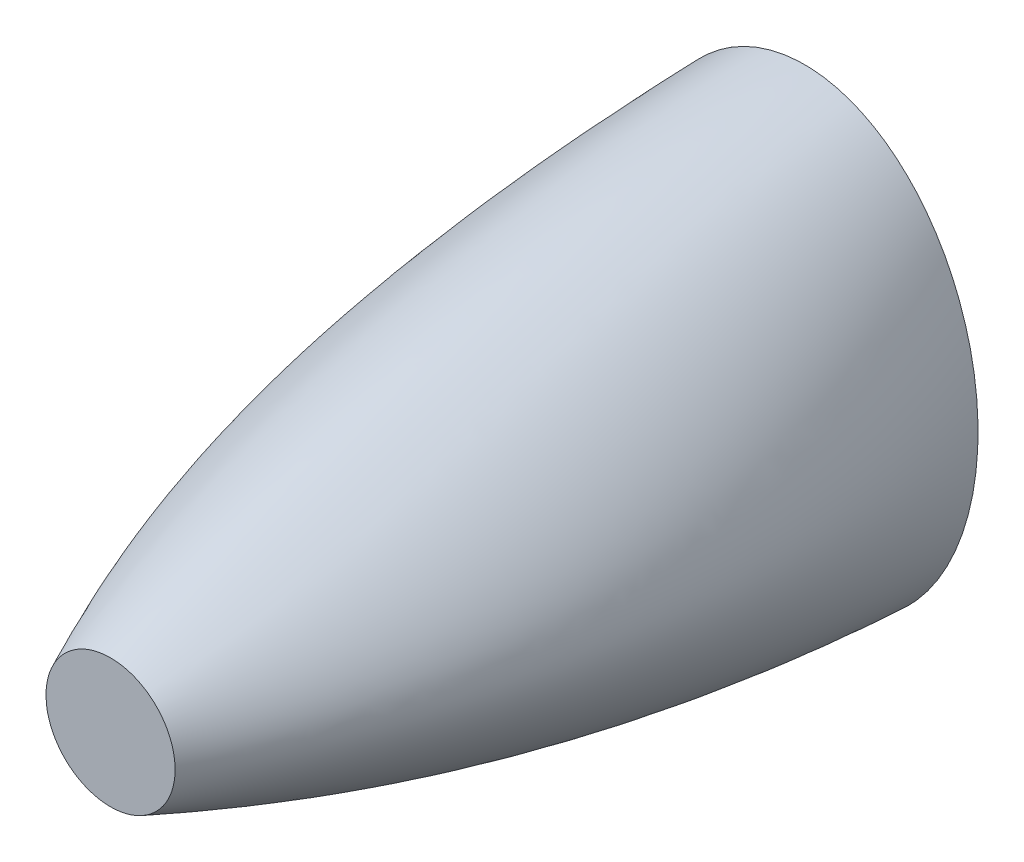
ISO-10303-21;
HEADER;
FILE_DESCRIPTION(('STEP AP214'),'2;1');
FILE_NAME('part.step','',(''),(''),'','','');
FILE_SCHEMA(('AUTOMOTIVE_DESIGN { 1 0 10303 214 1 1 1 1 }'));
ENDSEC;
DATA;
#1=APPLICATION_CONTEXT('core data for automotive mechanical design processes');
#2=APPLICATION_PROTOCOL_DEFINITION('international standard','automotive_design',2000,#1);
#3=PRODUCT_CONTEXT('',#1,'mechanical');
#4=PRODUCT('Part','Part','',(#3));
#5=PRODUCT_RELATED_PRODUCT_CATEGORY('part','',(#4));
#6=PRODUCT_DEFINITION_FORMATION('','',#4);
#7=PRODUCT_DEFINITION_CONTEXT('part definition',#1,'design');
#8=PRODUCT_DEFINITION('design','',#6,#7);
#9=PRODUCT_DEFINITION_SHAPE('','',#8);
#10=(LENGTH_UNIT() NAMED_UNIT(*) SI_UNIT(.MILLI.,.METRE.));
#11=(NAMED_UNIT(*) PLANE_ANGLE_UNIT() SI_UNIT($,.RADIAN.));
#12=(NAMED_UNIT(*) SI_UNIT($,.STERADIAN.) SOLID_ANGLE_UNIT());
#13=UNCERTAINTY_MEASURE_WITH_UNIT(LENGTH_MEASURE(1.E-05),#10,'distance_accuracy_value','');
#14=(GEOMETRIC_REPRESENTATION_CONTEXT(3) GLOBAL_UNCERTAINTY_ASSIGNED_CONTEXT((#13)) GLOBAL_UNIT_ASSIGNED_CONTEXT((#10,
#11,#12)) REPRESENTATION_CONTEXT('',''));
#15=CARTESIAN_POINT('',(0.,0.,0.));
#16=DIRECTION('',(0.,0.,1.));
#17=DIRECTION('',(1.,0.,0.));
#18=AXIS2_PLACEMENT_3D('',#15,#16,#17);
#19=CARTESIAN_POINT('',(0.,0.,150.));
#20=DIRECTION('',(0.,0.,1.));
#21=DIRECTION('',(1.,0.,0.));
#22=AXIS2_PLACEMENT_3D('',#19,#20,#21);
#23=PLANE('',#22);
#24=CARTESIAN_POINT('',(-13.8316253218808,-1.81346104317272,150.));
#25=CARTESIAN_POINT('',(-13.9552413467399,-0.870617222111307,150.));
#26=CARTESIAN_POINT('',(-14.0112193585026,1.0581492848484,150.));
#27=CARTESIAN_POINT('',(-13.4870008649816,3.95167657053692,150.));
#28=CARTESIAN_POINT('',(-12.353785590741,6.70545096247034,150.));
#29=CARTESIAN_POINT('',(-10.6474611528274,9.17898864103183,150.));
#30=CARTESIAN_POINT('',(-8.44098700988348,11.242443202228,150.));
#31=CARTESIAN_POINT('',(-5.84031007391976,12.7878734360822,150.));
#32=CARTESIAN_POINT('',(-3.45373508192225,13.5802923503004,150.));
#33=CARTESIAN_POINT('',(-1.48570546202716,13.897194033286,150.));
#34=CARTESIAN_POINT('',(-0.494400294097696,13.95,150.));
#35=CARTESIAN_POINT('',(0.494400395406497,13.95,150.));
#36=CARTESIAN_POINT('',(1.48570572809887,13.8971940120832,150.));
#37=CARTESIAN_POINT('',(3.4537355368622,13.5802922440873,150.));
#38=CARTESIAN_POINT('',(5.8403105213922,12.7878732228595,150.));
#39=CARTESIAN_POINT('',(8.44098722582768,11.242443013957,150.));
#40=CARTESIAN_POINT('',(10.6474611083233,9.1789886550765,150.));
#41=CARTESIAN_POINT('',(12.3537854066678,6.70545126223995,150.));
#42=CARTESIAN_POINT('',(13.4870007119411,3.95167707471874,150.));
#43=CARTESIAN_POINT('',(14.0112193390259,1.05814974496239,150.));
#44=CARTESIAN_POINT('',(13.9552413720703,-0.870617028910758,150.));
#45=CARTESIAN_POINT('',(13.7178598785402,-2.68117253467471,150.));
#46=CARTESIAN_POINT('',(13.3294272081842,-4.37372607660759,150.));
#47=CARTESIAN_POINT('',(12.3115742397595,-6.72189782377624,150.));
#48=CARTESIAN_POINT('',(10.9060186968567,-8.81736076057258,150.));
#49=CARTESIAN_POINT('',(9.16634907340913,-10.6139451651472,150.));
#50=CARTESIAN_POINT('',(7.14615386335008,-12.0654813156508,150.));
#51=CARTESIAN_POINT('',(4.9049611116128,-13.138272832167,150.));
#52=CARTESIAN_POINT('',(2.90274257121089,-13.6885649176776,150.));
#53=CARTESIAN_POINT('',(1.25351216484968,-13.9121558336949,150.));
#54=CARTESIAN_POINT('',(0.418624966044652,-13.95,150.));
#55=CARTESIAN_POINT('',(-0.418625059253773,-13.95,150.));
#56=CARTESIAN_POINT('',(-1.25351240743182,-13.9121558192276,150.));
#57=CARTESIAN_POINT('',(-2.90274298530917,-13.688564841036,150.));
#58=CARTESIAN_POINT('',(-4.90496154083023,-13.1382726616629,150.));
#59=CARTESIAN_POINT('',(-7.14615411756497,-12.065481154456,150.));
#60=CARTESIAN_POINT('',(-9.16634908876983,-10.6139451240254,150.));
#61=CARTESIAN_POINT('',(-10.9060185388055,-8.81736093910692,150.));
#62=CARTESIAN_POINT('',(-12.3115740227053,-6.72189819284992,150.));
#63=CARTESIAN_POINT('',(-13.329427095503,-4.3737264784039,150.));
#64=CARTESIAN_POINT('',(-13.7178598532098,-2.68117272787525,150.));
#65=CARTESIAN_POINT('',(-13.8316253218808,-1.81346104317272,150.));
#66=B_SPLINE_CURVE_WITH_KNOTS('',3,(#24,#25,#26,#27,#28,#29,#30,#31,#32,#33,#34,#35,#36,#37,#38,
#39,#40,#41,#42,#43,#44,#45,#46,#47,#48,#49,#50,#51,#52,#53,#54,#55,#56,#57,#58,#59,#60,#61,#62,
#63,#64,#65),.UNSPECIFIED.,.T.,.F.,(4,1,1,1,1,1,1,1,1,2,1,1,1,1,1,1,1,1,2,1,1,1,1,1,1,1,1,2,1,1,
1,1,1,1,1,1,4),(0.,0.03254677287094,0.06509354574188,0.0976403186128201,0.130187091483759,
0.162733864354699,0.195280637225639,0.227827410096579,0.244100796532049,0.260374182967519,
0.276647572737616,0.292920962507712,0.325467742047906,0.3580145215881,0.390561301128294,
0.423108080668487,0.455654860208681,0.488201639748875,0.520748419289069,0.550701639748886,
0.580654860208702,0.610608080668519,0.640561301128336,0.670514521588154,0.70046774204797,
0.730420962507787,0.745397572737695,0.760374182967604,0.775350796532129,0.790327410096654,
0.820280637225703,0.850233864354753,0.880187091483802,0.910140318612851,0.940093545741901,
0.970046772870951,1.),.UNSPECIFIED.);
#67=CARTESIAN_POINT('',(-13.8316253218808,-1.81346104317272,150.));
#68=VERTEX_POINT('',#67);
#69=EDGE_CURVE('E9',#68,#68,#66,.F.);
#70=ORIENTED_EDGE('',*,*,#69,.T.);
#71=EDGE_LOOP('',(#70));
#72=FACE_BOUND('',#71,.T.);
#73=ADVANCED_FACE('F14',(#72),#23,.T.);
#74=CARTESIAN_POINT('',(0.,0.,0.));
#75=DIRECTION('',(0.,0.,1.));
#76=DIRECTION('',(1.,0.,0.));
#77=AXIS2_PLACEMENT_3D('',#74,#75,#76);
#78=PLANE('',#77);
#79=CARTESIAN_POINT('',(-37.5,6.13647814420165E-07,0.));
#80=CARTESIAN_POINT('',(-37.5,-2.75862824576409,0.));
#81=CARTESIAN_POINT('',(-37.1578592845572,-8.33129337094394,0.));
#82=CARTESIAN_POINT('',(-35.5508442765686,-16.69821158453,0.));
#83=CARTESIAN_POINT('',(-32.7701715041672,-24.8777268594379,0.));
#84=CARTESIAN_POINT('',(-28.7293303871629,-32.6171804294194,0.));
#85=CARTESIAN_POINT('',(-23.3505855635259,-39.5710446011628,0.));
#86=CARTESIAN_POINT('',(-16.6140313731737,-45.2694741492397,0.));
#87=CARTESIAN_POINT('',(-9.98905441709001,-48.4594463327748,0.));
#88=CARTESIAN_POINT('',(-4.32390640968859,-49.7773670150795,0.));
#89=CARTESIAN_POINT('',(-1.4390292890435,-49.9999999999976,0.));
#90=CARTESIAN_POINT('',(1.43902958324984,-50.0000000000024,0.));
#91=CARTESIAN_POINT('',(4.32390718155091,-49.7773669266518,0.));
#92=CARTESIAN_POINT('',(9.98905570538961,-48.4594458945443,0.));
#93=CARTESIAN_POINT('',(16.6140325606245,-45.269473330424,0.));
#94=CARTESIAN_POINT('',(23.3505860835235,-39.5710439628917,0.));
#95=CARTESIAN_POINT('',(28.7293302711852,-32.6171805043616,0.));
#96=CARTESIAN_POINT('',(32.7701710677231,-24.8777277886173,0.));
#97=CARTESIAN_POINT('',(35.5508438798595,-16.6982130596302,0.));
#98=CARTESIAN_POINT('',(37.157859146374,-8.33129469023896,0.));
#99=CARTESIAN_POINT('',(37.5,-2.75862880993872,0.));
#100=CARTESIAN_POINT('',(37.5,2.99748888363315,0.));
#101=CARTESIAN_POINT('',(37.0970673259213,8.92754348537529,0.));
#102=CARTESIAN_POINT('',(35.3355773244425,17.5174431329251,0.));
#103=CARTESIAN_POINT('',(32.4204683095786,25.6755979688145,0.));
#104=CARTESIAN_POINT('',(28.3202945113603,33.2309214433553,0.));
#105=CARTESIAN_POINT('',(22.9832917639787,39.9299394275931,0.));
#106=CARTESIAN_POINT('',(16.3813848252202,45.3975291975286,0.));
#107=CARTESIAN_POINT('',(9.89814847301178,48.4834807587826,0.));
#108=CARTESIAN_POINT('',(4.30885683051951,49.7778288540367,0.));
#109=CARTESIAN_POINT('',(1.43902927623135,50.,0.));
#110=CARTESIAN_POINT('',(-1.439029596062,50.,0.));
#111=CARTESIAN_POINT('',(-4.30885766361633,49.7778287582911,0.));
#112=CARTESIAN_POINT('',(-9.89814985942237,48.483480291567,0.));
#113=CARTESIAN_POINT('',(-16.3813861408714,45.3975283155135,0.));
#114=CARTESIAN_POINT('',(-22.983292438452,39.9299386526483,0.));
#115=CARTESIAN_POINT('',(-28.3202945287553,33.2309213128155,0.));
#116=CARTESIAN_POINT('',(-32.4204679362142,25.6755987036377,0.));
#117=CARTESIAN_POINT('',(-35.3355769161142,17.5174445407298,0.));
#118=CARTESIAN_POINT('',(-37.0970671558329,8.92754491102934,0.));
#119=CARTESIAN_POINT('',(-37.5,2.99748954983739,0.));
#120=CARTESIAN_POINT('',(-37.5,6.13647814420165E-07,0.));
#121=B_SPLINE_CURVE_WITH_KNOTS('',3,(#79,#80,#81,#82,#83,#84,#85,#86,#87,#88,#89,#90,#91,#92,
#93,#94,#95,#96,#97,#98,#99,#100,#101,#102,#103,#104,#105,#106,#107,#108,#109,#110,#111,#112,
#113,#114,#115,#116,#117,#118,#119,#120),.UNSPECIFIED.,.T.,.F.,(4,1,1,1,1,1,1,1,1,2,1,1,1,1,1,1,
1,1,2,1,1,1,1,1,1,1,1,2,1,1,1,1,1,1,1,1,4),(0.,0.0299532271290495,0.059906454258099,
0.0898596813871485,0.119812908516198,0.149766135645247,0.179719362774297,0.209672589903347,
0.224649203467871,0.239625817032396,0.254602427262305,0.269579037492213,0.29953225795203,
0.329485478411846,0.359438698871664,0.38939191933148,0.419345139791298,0.449298360251115,
0.479251580710931,0.511798360251125,0.544345139791319,0.576891919331513,0.609438698871706,
0.6419854784119,0.674532257952094,0.707079037492288,0.723352427262384,0.739625817032481,
0.755899203467951,0.772172589903421,0.804719362774361,0.837266135645301,0.869812908516241,
0.90235968138718,0.93490645425812,0.96745322712906,1.),.UNSPECIFIED.);
#122=CARTESIAN_POINT('',(-37.5,6.13647814420165E-07,0.));
#123=VERTEX_POINT('',#122);
#124=EDGE_CURVE('E23',#123,#123,#121,.T.);
#125=ORIENTED_EDGE('',*,*,#124,.F.);
#126=EDGE_LOOP('',(#125));
#127=FACE_BOUND('',#126,.T.);
#128=ADVANCED_FACE('F49',(#127),#78,.F.);
#129=CARTESIAN_POINT('',(-37.5,6.13647814420165E-07,0.));
#130=CARTESIAN_POINT('',(-47.3792555773812,0.567763826369722,52.7162328506658));
#131=CARTESIAN_POINT('',(-39.489797351326,-0.0367231881392026,102.716232850666));
#132=CARTESIAN_POINT('',(-13.8316253218808,-1.81346104317272,150.));
#133=CARTESIAN_POINT('',(-37.5,-2.75862824576409,0.));
#134=CARTESIAN_POINT('',(-47.2868411541833,-1.55889011913283,52.7162328506658));
#135=CARTESIAN_POINT('',(-39.3595598579495,-1.53099445313962,102.716232850666));
#136=CARTESIAN_POINT('',(-13.7178598532098,-2.68117272787525,150.));
#137=CARTESIAN_POINT('',(-37.1578592845572,-8.33129337094394,0.));
#138=CARTESIAN_POINT('',(-46.292258557572,-6.15869310010679,52.6993942430707));
#139=CARTESIAN_POINT('',(-38.3496947064503,-4.83431154888646,102.699394243071));
#140=CARTESIAN_POINT('',(-13.329427095503,-4.3737264784039,150.));
#141=CARTESIAN_POINT('',(-35.5508442765686,-16.69821158453,0.));
#142=CARTESIAN_POINT('',(-42.7431642424252,-13.7289364951854,52.6362494645894));
#143=CARTESIAN_POINT('',(-34.9970895297637,-10.3961642744136,102.636249464589));
#144=CARTESIAN_POINT('',(-12.3115740227053,-6.72189819284992,150.));
#145=CARTESIAN_POINT('',(-32.7701715041672,-24.8777268594379,0.));
#146=CARTESIAN_POINT('',(-37.5005756434956,-21.5760912860561,52.5478467747156));
#147=CARTESIAN_POINT('',(-30.2128826015956,-16.2151068746861,102.547846774716));
#148=CARTESIAN_POINT('',(-10.9060185388055,-8.81736093910692,150.));
#149=CARTESIAN_POINT('',(-28.7293303871629,-32.6171804294194,0.));
#150=CARTESIAN_POINT('',(-30.9258100367732,-29.2735998982885,52.4468151291455));
#151=CARTESIAN_POINT('',(-24.405118649589,-21.9328273510862,102.446815129146));
#152=CARTESIAN_POINT('',(-9.16634908876983,-10.6139451240254,150.));
#153=CARTESIAN_POINT('',(-23.3505855635259,-39.5710446011628,0.));
#154=CARTESIAN_POINT('',(-23.3860348436879,-36.33299213941,52.3457834835753));
#155=CARTESIAN_POINT('',(-17.9847674741071,-27.160057395975,102.345783483575));
#156=CARTESIAN_POINT('',(-7.14615411756497,-12.065481154456,150.));
#157=CARTESIAN_POINT('',(-16.6140313731737,-45.2694741492397,0.));
#158=CARTESIAN_POINT('',(-15.2889504438591,-42.1870772036745,52.2573807937013));
#159=CARTESIAN_POINT('',(-11.386035089944,-31.4744050072838,102.257380793701));
#160=CARTESIAN_POINT('',(-4.90496154083023,-13.1382726616629,150.));
#161=CARTESIAN_POINT('',(-9.98905441709001,-48.4594463327748,0.));
#162=CARTESIAN_POINT('',(-8.50798212686978,-45.5077425057592,52.2047601449669));
#163=CARTESIAN_POINT('',(-6.14591679430498,-33.9166373540175,102.204760144967));
#164=CARTESIAN_POINT('',(-2.90274298530917,-13.688564841036,150.));
#165=CARTESIAN_POINT('',(-4.32390640968859,-49.7773670150795,0.));
#166=CARTESIAN_POINT('',(-3.43585423468451,-46.9055759567585,52.1816070595238));
#167=CARTESIAN_POINT('',(-2.41239563765931,-34.9503757468191,102.181607059524));
#168=CARTESIAN_POINT('',(-1.25351240743182,-13.9121558192276,150.));
#169=CARTESIAN_POINT('',(-1.4390292890435,-49.9999999999976,0.));
#170=CARTESIAN_POINT('',(-1.09889475072625,-47.1474700223203,52.177397407625));
#171=CARTESIAN_POINT('',(-0.758759905011952,-35.1308033556544,102.177397407625));
#172=CARTESIAN_POINT('',(-0.418625059253773,-13.95,150.));
#173=CARTESIAN_POINT('',(1.43902958324984,-50.0000000000024,0.));
#174=CARTESIAN_POINT('',(1.09889450590212,-47.1474700223227,52.177397407625));
#175=CARTESIAN_POINT('',(0.758759735951445,-35.1308033556553,102.177397407625));
#176=CARTESIAN_POINT('',(0.418624966044652,-13.95,150.));
#177=CARTESIAN_POINT('',(4.32390718155091,-49.7773669266518,0.));
#178=CARTESIAN_POINT('',(3.43585426255573,-46.9055758962604,52.1816070595238));
#179=CARTESIAN_POINT('',(2.41239553068221,-34.9503757238472,102.181607059524));
#180=CARTESIAN_POINT('',(1.25351216484968,-13.9121558336949,150.));
#181=CARTESIAN_POINT('',(9.98905570538961,-48.4594458945443,0.));
#182=CARTESIAN_POINT('',(8.50798246391847,-45.507742197759,52.204760144967));
#183=CARTESIAN_POINT('',(6.14591675837544,-33.9166372386146,102.204760144967));
#184=CARTESIAN_POINT('',(2.90274257121089,-13.6885649176776,150.));
#185=CARTESIAN_POINT('',(16.6140325606245,-45.269473330424,0.));
#186=CARTESIAN_POINT('',(15.28895075819,-42.1870765936214,52.2573807937014));
#187=CARTESIAN_POINT('',(11.3860350398467,-31.4744047882863,102.257380793701));
#188=CARTESIAN_POINT('',(4.9049611116128,-13.138272832167,150.));
#189=CARTESIAN_POINT('',(23.3505860835235,-39.5710439628917,0.));
#190=CARTESIAN_POINT('',(23.3860348526037,-36.3329915128016,52.3457834835753));
#191=CARTESIAN_POINT('',(17.984767365772,-27.1600571647799,102.345783483575));
#192=CARTESIAN_POINT('',(7.14615386335008,-12.0654813156508,150.));
#193=CARTESIAN_POINT('',(28.7293302711852,-32.6171805043616,0.));
#194=CARTESIAN_POINT('',(30.9258097908795,-29.2735995541023,52.4468151291454));
#195=CARTESIAN_POINT('',(24.4051185396131,-21.9328272017343,102.446815129145));
#196=CARTESIAN_POINT('',(9.16634907340913,-10.6139451651472,150.));
#197=CARTESIAN_POINT('',(32.7701710677231,-24.8777277886173,0.));
#198=CARTESIAN_POINT('',(37.5005753262372,-21.5760912849613,52.5478467747156));
#199=CARTESIAN_POINT('',(30.2128825464487,-16.2151067874534,102.547846774716));
#200=CARTESIAN_POINT('',(10.9060186968567,-8.81736076057258,150.));
#201=CARTESIAN_POINT('',(35.5508438798595,-16.6982130596302,0.));
#202=CARTESIAN_POINT('',(42.7431640373021,-13.7289366602525,52.6362494645895));
#203=CARTESIAN_POINT('',(34.9970895595603,-10.3961641749261,102.63624946459));
#204=CARTESIAN_POINT('',(12.3115742397595,-6.72189782377624,150.));
#205=CARTESIAN_POINT('',(37.157859146374,-8.33129469023896,0.));
#206=CARTESIAN_POINT('',(46.2922585240713,-6.15869305409479,52.6993942430708));
#207=CARTESIAN_POINT('',(38.3496947629153,-4.83431132676375,102.699394243071));
#208=CARTESIAN_POINT('',(13.3294272081842,-4.37372607660759,150.));
#209=CARTESIAN_POINT('',(37.5,-2.75862880993872,0.));
#210=CARTESIAN_POINT('',(47.2868411761748,-1.55888961305955,52.7162328506658));
#211=CARTESIAN_POINT('',(39.359559888361,-1.53099410421535,102.716232850666));
#212=CARTESIAN_POINT('',(13.7178598785402,-2.68117253467471,150.));
#213=CARTESIAN_POINT('',(37.5,2.99748888363315,0.));
#214=CARTESIAN_POINT('',(47.4796718630504,2.87855777736921,52.7162328506658));
#215=CARTESIAN_POINT('',(39.6313116836725,1.58693214281585,102.716232850666));
#216=CARTESIAN_POINT('',(13.9552413720703,-0.870617028910758,150.));
#217=CARTESIAN_POINT('',(37.0970673259213,8.92754348537529,0.));
#218=CARTESIAN_POINT('',(46.7632535061027,7.72187561188174,52.6993942430708));
#219=CARTESIAN_POINT('',(39.0677025821234,5.09310218587742,102.699394243071));
#220=CARTESIAN_POINT('',(14.0112193390259,1.05814974496239,150.));
#221=CARTESIAN_POINT('',(35.3355773244425,17.5174431329251,0.));
#222=CARTESIAN_POINT('',(43.3929774485971,15.3476631644167,52.6362494645894));
#223=CARTESIAN_POINT('',(36.1097396474634,10.8177716726659,102.636249464589));
#224=CARTESIAN_POINT('',(13.4870007119411,3.95167707471874,150.));
#225=CARTESIAN_POINT('',(32.4204683095786,25.6755979688145,0.));
#226=CARTESIAN_POINT('',(38.1622044540404,23.0153564529209,52.5478467747156));
#227=CARTESIAN_POINT('',(31.4729211462745,16.6837932043408,102.547846774716));
#228=CARTESIAN_POINT('',(12.3537854066678,6.70545126223995,150.));
#229=CARTESIAN_POINT('',(28.3202945113603,33.2309214433553,0.));
#230=CARTESIAN_POINT('',(31.4950405380988,30.3762499701143,52.4468151291452));
#231=CARTESIAN_POINT('',(25.6037674025749,22.3520275117168,102.446815129145));
#232=CARTESIAN_POINT('',(10.6474611083233,9.1789886550765,150.));
#233=CARTESIAN_POINT('',(22.9832917639787,39.9299394275931,0.));
#234=CARTESIAN_POINT('',(23.8144033604788,37.0302589602651,52.3457834835753));
#235=CARTESIAN_POINT('',(18.9667404243042,27.4629644079718,102.345783483575));
#236=CARTESIAN_POINT('',(8.44098722582768,11.242443013957,150.));
#237=CARTESIAN_POINT('',(16.3813848252202,45.3975291975286,0.));
#238=CARTESIAN_POINT('',(15.5699989810484,42.5035013120284,52.2573807937014));
#239=CARTESIAN_POINT('',(12.0561900961281,31.631147590102,102.257380793701));
#240=CARTESIAN_POINT('',(5.8403105213922,12.7878732228595,150.));
#241=CARTESIAN_POINT('',(9.89814847301178,48.4834807587826,0.));
#242=CARTESIAN_POINT('',(8.67545779160548,45.6066748599185,52.204760144967));
#243=CARTESIAN_POINT('',(6.52727813360264,33.97139711844,102.204760144967));
#244=CARTESIAN_POINT('',(3.4537355368622,13.5802922440873,150.));
#245=CARTESIAN_POINT('',(4.30885683051951,49.7778288540367,0.));
#246=CARTESIAN_POINT('',(3.51032542633757,46.9192039666341,52.1816070595238));
#247=CARTESIAN_POINT('',(2.56926825076701,34.9588513015275,102.181607059524));
#248=CARTESIAN_POINT('',(1.48570572809887,13.8971940120832,150.));
#249=CARTESIAN_POINT('',(1.43902927623135,50.,0.));
#250=CARTESIAN_POINT('',(1.12415318745028,47.1474700223215,52.177397407625));
#251=CARTESIAN_POINT('',(0.809276791406448,35.1308033556548,102.177397407625));
#252=CARTESIAN_POINT('',(0.494400395406497,13.95,150.));
#253=CARTESIAN_POINT('',(-1.439029596062,50.,0.));
#254=CARTESIAN_POINT('',(-1.12415295724668,47.1474700223215,52.177397407625));
#255=CARTESIAN_POINT('',(-0.809276625694131,35.1308033556548,102.177397407625));
#256=CARTESIAN_POINT('',(-0.494400294097696,13.95,150.));
#257=CARTESIAN_POINT('',(-4.30885766361633,49.7778287582911,0.));
#258=CARTESIAN_POINT('',(-3.51032548592865,46.9192039035,52.1816070595238));
#259=CARTESIAN_POINT('',(-2.56926814724038,34.958851280598,102.181607059524));
#260=CARTESIAN_POINT('',(-1.48570546202716,13.897194033286,150.));
#261=CARTESIAN_POINT('',(-9.89814985942237,48.483480291567,0.));
#262=CARTESIAN_POINT('',(-8.67545817124202,45.6066745424267,52.204760144967));
#263=CARTESIAN_POINT('',(-6.52727809393107,33.9713970130266,102.204760144967));
#264=CARTESIAN_POINT('',(-3.45373508192225,13.5802923503004,150.));
#265=CARTESIAN_POINT('',(-16.3813861408714,45.3975283155135,0.));
#266=CARTESIAN_POINT('',(-15.5699993485565,42.5035006740053,52.2573807937013));
#267=CARTESIAN_POINT('',(-12.0561900504111,31.6311473783345,102.257380793701));
#268=CARTESIAN_POINT('',(-5.84031007391976,12.7878734360822,150.));
#269=CARTESIAN_POINT('',(-22.983292438452,39.9299386526483,0.));
#270=CARTESIAN_POINT('',(-23.8144034339934,37.0302582514125,52.3457834835753));
#271=CARTESIAN_POINT('',(-18.9667403419049,27.46296414891,102.345783483575));
#272=CARTESIAN_POINT('',(-8.44098700988348,11.242443202228,150.));
#273=CARTESIAN_POINT('',(-28.3202945287553,33.2309213128155,0.));
#274=CARTESIAN_POINT('',(-31.4950403272541,30.3762494703263,52.4468151291455));
#275=CARTESIAN_POINT('',(-25.6037673032642,22.3520272565716,102.446815129146));
#276=CARTESIAN_POINT('',(-10.6474611528274,9.17898864103183,150.));
#277=CARTESIAN_POINT('',(-32.4204679362142,25.6755987036377,0.));
#278=CARTESIAN_POINT('',(-38.1622041000629,23.0153562815751,52.5478467747154));
#279=CARTESIAN_POINT('',(-31.4729210422051,16.6837929708796,102.547846774715));
#280=CARTESIAN_POINT('',(-12.353785590741,6.70545096247034,150.));
#281=CARTESIAN_POINT('',(-35.3355769161142,17.5174445407298,0.));
#282=CARTESIAN_POINT('',(-43.3929771291683,15.3476632393212,52.6362494645896));
#283=CARTESIAN_POINT('',(-36.1097395456395,10.8177714600695,102.63624946459));
#284=CARTESIAN_POINT('',(-13.4870008649816,3.95167657053692,150.));
#285=CARTESIAN_POINT('',(-37.0970671558329,8.92754491102934,0.));
#286=CARTESIAN_POINT('',(-46.7632533599122,7.72187561714963,52.6993942430706));
#287=CARTESIAN_POINT('',(-39.067702505574,5.09310195990016,102.69939424307));
#288=CARTESIAN_POINT('',(-14.0112193585026,1.0581492848484,150.));
#289=CARTESIAN_POINT('',(-37.5,2.99748954983739,0.));
#290=CARTESIAN_POINT('',(-47.4796718440114,2.87855733924074,52.7162328506658));
#291=CARTESIAN_POINT('',(-39.6313116562103,1.58693182772966,102.716232850666));
#292=CARTESIAN_POINT('',(-13.9552413467399,-0.870617222111307,150.));
#293=CARTESIAN_POINT('',(-37.5,6.13647814420165E-07,0.));
#294=CARTESIAN_POINT('',(-47.3792555773812,0.567763826369722,52.7162328506658));
#295=CARTESIAN_POINT('',(-39.489797351326,-0.0367231881392026,102.716232850666));
#296=CARTESIAN_POINT('',(-13.8316253218808,-1.81346104317272,150.));
#297=B_SPLINE_SURFACE_WITH_KNOTS('',3,3,((#129,#130,#131,#132),(#133,#134,#135,#136),(#137,#138,
#139,#140),(#141,#142,#143,#144),(#145,#146,#147,#148),(#149,#150,#151,#152),(#153,#154,#155,
#156),(#157,#158,#159,#160),(#161,#162,#163,#164),(#165,#166,#167,#168),(#169,#170,#171,#172),
(#173,#174,#175,#176),(#177,#178,#179,#180),(#181,#182,#183,#184),(#185,#186,#187,#188),(#189,
#190,#191,#192),(#193,#194,#195,#196),(#197,#198,#199,#200),(#201,#202,#203,#204),(#205,#206,
#207,#208),(#209,#210,#211,#212),(#213,#214,#215,#216),(#217,#218,#219,#220),(#221,#222,#223,
#224),(#225,#226,#227,#228),(#229,#230,#231,#232),(#233,#234,#235,#236),(#237,#238,#239,#240),
(#241,#242,#243,#244),(#245,#246,#247,#248),(#249,#250,#251,#252),(#253,#254,#255,#256),(#257,
#258,#259,#260),(#261,#262,#263,#264),(#265,#266,#267,#268),(#269,#270,#271,#272),(#273,#274,
#275,#276),(#277,#278,#279,#280),(#281,#282,#283,#284),(#285,#286,#287,#288),(#289,#290,#291,
#292),(#293,#294,#295,#296)),.UNSPECIFIED.,.T.,.F.,.F.,(4,1,1,1,1,1,1,1,1,2,1,1,1,1,1,1,1,1,2,1,
1,1,1,1,1,1,1,2,1,1,1,1,1,1,1,1,4),(4,4),(0.,0.0299532271290495,0.059906454258099,
0.0898596813871485,0.119812908516198,0.149766135645247,0.179719362774297,0.209672589903347,
0.224649203467871,0.239625817032396,0.254602427262305,0.269579037492213,0.29953225795203,
0.329485478411846,0.359438698871664,0.38939191933148,0.419345139791298,0.449298360251115,
0.479251580710931,0.511798360251125,0.544345139791319,0.576891919331513,0.609438698871706,
0.6419854784119,0.674532257952094,0.707079037492288,0.723352427262384,0.739625817032481,
0.755899203467951,0.772172589903421,0.804719362774361,0.837266135645301,0.869812908516241,
0.90235968138718,0.93490645425812,0.96745322712906,1.),(0.,1.),.UNSPECIFIED.);
#298=ORIENTED_EDGE('',*,*,#124,.T.);
#299=EDGE_LOOP('',(#298));
#300=FACE_BOUND('',#299,.T.);
#301=ORIENTED_EDGE('',*,*,#69,.F.);
#302=EDGE_LOOP('',(#301));
#303=FACE_BOUND('',#302,.T.);
#304=ADVANCED_FACE('F30',(#300,#303),#297,.T.);
#305=CLOSED_SHELL('',(#73,#128,#304));
#306=MANIFOLD_SOLID_BREP('B1',#305);
#307=ADVANCED_BREP_SHAPE_REPRESENTATION('',(#18,#306),#14);
#308=SHAPE_DEFINITION_REPRESENTATION(#9,#307);
ENDSEC;
END-ISO-10303-21;
